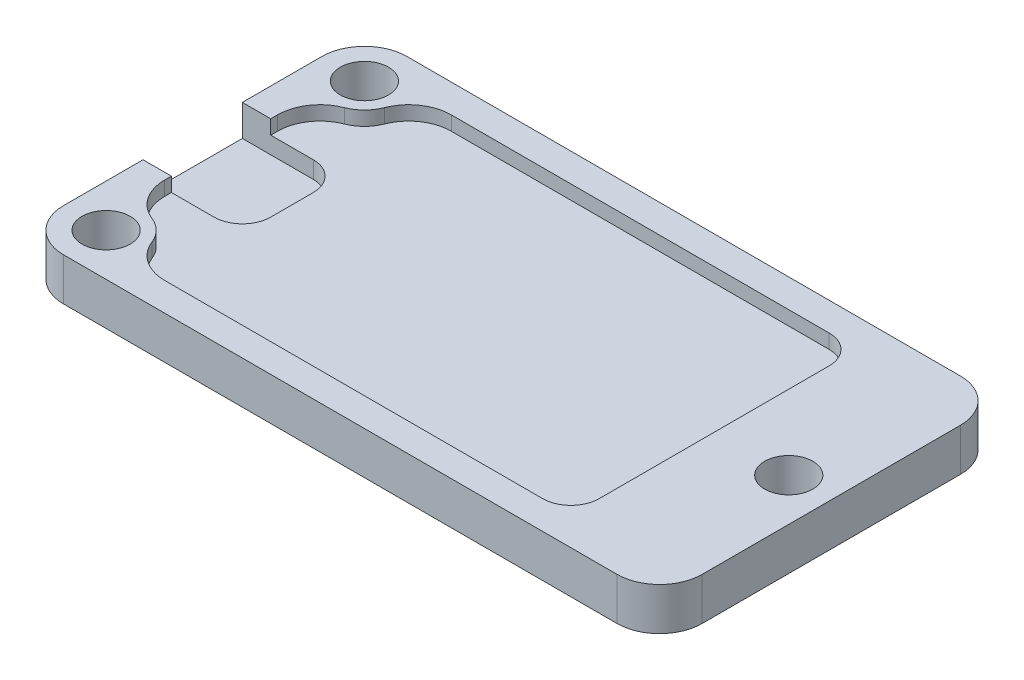
ISO-10303-21;
HEADER;
FILE_DESCRIPTION(('STEP AP214'),'2;1');
FILE_NAME('part.step','',(''),(''),'','','');
FILE_SCHEMA(('AUTOMOTIVE_DESIGN { 1 0 10303 214 1 1 1 1 }'));
ENDSEC;
DATA;
#1=APPLICATION_CONTEXT('core data for automotive mechanical design processes');
#2=APPLICATION_PROTOCOL_DEFINITION('international standard','automotive_design',2000,#1);
#3=PRODUCT_CONTEXT('',#1,'mechanical');
#4=PRODUCT('Part','Part','',(#3));
#5=PRODUCT_RELATED_PRODUCT_CATEGORY('part','',(#4));
#6=PRODUCT_DEFINITION_FORMATION('','',#4);
#7=PRODUCT_DEFINITION_CONTEXT('part definition',#1,'design');
#8=PRODUCT_DEFINITION('design','',#6,#7);
#9=PRODUCT_DEFINITION_SHAPE('','',#8);
#10=(LENGTH_UNIT() NAMED_UNIT(*) SI_UNIT(.MILLI.,.METRE.));
#11=(NAMED_UNIT(*) PLANE_ANGLE_UNIT() SI_UNIT($,.RADIAN.));
#12=(NAMED_UNIT(*) SI_UNIT($,.STERADIAN.) SOLID_ANGLE_UNIT());
#13=UNCERTAINTY_MEASURE_WITH_UNIT(LENGTH_MEASURE(1.E-05),#10,'distance_accuracy_value','');
#14=(GEOMETRIC_REPRESENTATION_CONTEXT(3) GLOBAL_UNCERTAINTY_ASSIGNED_CONTEXT((#13)) GLOBAL_UNIT_ASSIGNED_CONTEXT((#10,
#11,#12)) REPRESENTATION_CONTEXT('',''));
#15=CARTESIAN_POINT('',(0.,0.,0.));
#16=DIRECTION('',(0.,0.,1.));
#17=DIRECTION('',(1.,0.,0.));
#18=AXIS2_PLACEMENT_3D('',#15,#16,#17);
#19=CARTESIAN_POINT('',(2.,2.,-8.1234753829798));
#20=DIRECTION('',(-1.,0.,0.));
#21=DIRECTION('',(0.,0.,1.));
#22=AXIS2_PLACEMENT_3D('',#19,#20,#21);
#23=PLANE('',#22);
#24=DIRECTION('',(0.,0.,1.));
#25=VECTOR('',#24,1.);
#26=CARTESIAN_POINT('',(2.,2.,-8.1234753829798));
#27=LINE('',#26,#25);
#28=CARTESIAN_POINT('',(2.,2.,-8.6));
#29=VERTEX_POINT('',#28);
#30=CARTESIAN_POINT('',(2.,2.,-8.1234753829798));
#31=VERTEX_POINT('',#30);
#32=EDGE_CURVE('E279',#29,#31,#27,.T.);
#33=ORIENTED_EDGE('',*,*,#32,.F.);
#34=DIRECTION('',(0.,1.,0.));
#35=VECTOR('',#34,1.);
#36=CARTESIAN_POINT('',(2.,2.,-8.6));
#37=LINE('',#36,#35);
#38=CARTESIAN_POINT('',(2.,3.,-8.6));
#39=VERTEX_POINT('',#38);
#40=EDGE_CURVE('E251',#29,#39,#37,.T.);
#41=ORIENTED_EDGE('',*,*,#40,.T.);
#42=DIRECTION('',(0.,0.,1.));
#43=VECTOR('',#42,1.);
#44=CARTESIAN_POINT('',(2.,3.,-8.1234753829798));
#45=LINE('',#44,#43);
#46=CARTESIAN_POINT('',(2.,3.,-8.1234753829798));
#47=VERTEX_POINT('',#46);
#48=EDGE_CURVE('E308',#39,#47,#45,.T.);
#49=ORIENTED_EDGE('',*,*,#48,.T.);
#50=DIRECTION('',(0.,1.,0.));
#51=VECTOR('',#50,1.);
#52=CARTESIAN_POINT('',(2.,2.,-8.1234753829798));
#53=LINE('',#52,#51);
#54=EDGE_CURVE('E317',#31,#47,#53,.T.);
#55=ORIENTED_EDGE('',*,*,#54,.F.);
#56=EDGE_LOOP('',(#33,#41,#49,#55));
#57=FACE_BOUND('',#56,.T.);
#58=ADVANCED_FACE('F35',(#57),#23,.F.);
#59=CARTESIAN_POINT('',(0.,3.,0.));
#60=DIRECTION('',(1.,0.,0.));
#61=DIRECTION('',(0.,0.,-1.));
#62=AXIS2_PLACEMENT_3D('',#59,#60,#61);
#63=PLANE('',#62);
#64=DIRECTION('',(0.,0.,1.));
#65=VECTOR('',#64,1.);
#66=CARTESIAN_POINT('',(0.,3.,0.));
#67=LINE('',#66,#65);
#68=CARTESIAN_POINT('',(0.,3.,-8.6));
#69=VERTEX_POINT('',#68);
#70=CARTESIAN_POINT('',(0.,3.,-3.));
#71=VERTEX_POINT('',#70);
#72=EDGE_CURVE('E354',#69,#71,#67,.T.);
#73=ORIENTED_EDGE('',*,*,#72,.F.);
#74=DIRECTION('',(0.,1.,0.));
#75=VECTOR('',#74,1.);
#76=CARTESIAN_POINT('',(0.,0.8,-8.6));
#77=LINE('',#76,#75);
#78=CARTESIAN_POINT('',(0.,0.8,-8.6));
#79=VERTEX_POINT('',#78);
#80=EDGE_CURVE('E236',#79,#69,#77,.T.);
#81=ORIENTED_EDGE('',*,*,#80,.F.);
#82=DIRECTION('',(0.,0.,1.));
#83=VECTOR('',#82,1.);
#84=CARTESIAN_POINT('',(0.,0.8,-8.6));
#85=LINE('',#84,#83);
#86=CARTESIAN_POINT('',(0.,0.8,-15.6));
#87=VERTEX_POINT('',#86);
#88=EDGE_CURVE('E223',#87,#79,#85,.T.);
#89=ORIENTED_EDGE('',*,*,#88,.F.);
#90=DIRECTION('',(0.,1.,0.));
#91=VECTOR('',#90,1.);
#92=CARTESIAN_POINT('',(0.,0.8,-15.6));
#93=LINE('',#92,#91);
#94=CARTESIAN_POINT('',(0.,3.,-15.6));
#95=VERTEX_POINT('',#94);
#96=EDGE_CURVE('E229',#87,#95,#93,.T.);
#97=ORIENTED_EDGE('',*,*,#96,.T.);
#98=CARTESIAN_POINT('',(0.,3.,-21.2));
#99=VERTEX_POINT('',#98);
#100=EDGE_CURVE('E351',#99,#95,#67,.T.);
#101=ORIENTED_EDGE('',*,*,#100,.F.);
#102=DIRECTION('',(0.,-1.,0.));
#103=VECTOR('',#102,1.);
#104=CARTESIAN_POINT('',(0.,3.,-21.2));
#105=LINE('',#104,#103);
#106=CARTESIAN_POINT('',(0.,0.,-21.2));
#107=VERTEX_POINT('',#106);
#108=EDGE_CURVE('E387',#99,#107,#105,.T.);
#109=ORIENTED_EDGE('',*,*,#108,.T.);
#110=DIRECTION('',(0.,0.,1.));
#111=VECTOR('',#110,1.);
#112=CARTESIAN_POINT('',(0.,0.,0.));
#113=LINE('',#112,#111);
#114=CARTESIAN_POINT('',(0.,0.,-3.));
#115=VERTEX_POINT('',#114);
#116=EDGE_CURVE('E350',#107,#115,#113,.T.);
#117=ORIENTED_EDGE('',*,*,#116,.T.);
#118=DIRECTION('',(0.,-1.,0.));
#119=VECTOR('',#118,1.);
#120=CARTESIAN_POINT('',(0.,3.,-3.));
#121=LINE('',#120,#119);
#122=EDGE_CURVE('E390',#115,#71,#121,.F.);
#123=ORIENTED_EDGE('',*,*,#122,.T.);
#124=EDGE_LOOP('',(#73,#81,#89,#97,#101,#109,#117,#123));
#125=FACE_BOUND('',#124,.T.);
#126=ADVANCED_FACE('F239',(#125),#63,.F.);
#127=CARTESIAN_POINT('',(0.,3.,0.));
#128=DIRECTION('',(0.,0.,-1.));
#129=DIRECTION('',(-1.,0.,0.));
#130=AXIS2_PLACEMENT_3D('',#127,#128,#129);
#131=PLANE('',#130);
#132=DIRECTION('',(1.,0.,0.));
#133=VECTOR('',#132,1.);
#134=CARTESIAN_POINT('',(0.,3.,0.));
#135=LINE('',#134,#133);
#136=CARTESIAN_POINT('',(3.,3.,0.));
#137=VERTEX_POINT('',#136);
#138=CARTESIAN_POINT('',(42.,3.,0.));
#139=VERTEX_POINT('',#138);
#140=EDGE_CURVE('E353',#137,#139,#135,.T.);
#141=ORIENTED_EDGE('',*,*,#140,.F.);
#142=DIRECTION('',(0.,-1.,0.));
#143=VECTOR('',#142,1.);
#144=CARTESIAN_POINT('',(3.,3.,0.));
#145=LINE('',#144,#143);
#146=CARTESIAN_POINT('',(3.,0.,0.));
#147=VERTEX_POINT('',#146);
#148=EDGE_CURVE('E376',#137,#147,#145,.T.);
#149=ORIENTED_EDGE('',*,*,#148,.T.);
#150=DIRECTION('',(1.,0.,0.));
#151=VECTOR('',#150,1.);
#152=CARTESIAN_POINT('',(0.,0.,0.));
#153=LINE('',#152,#151);
#154=CARTESIAN_POINT('',(42.,0.,0.));
#155=VERTEX_POINT('',#154);
#156=EDGE_CURVE('E366',#147,#155,#153,.T.);
#157=ORIENTED_EDGE('',*,*,#156,.T.);
#158=DIRECTION('',(0.,-1.,0.));
#159=VECTOR('',#158,1.);
#160=CARTESIAN_POINT('',(42.,3.,0.));
#161=LINE('',#160,#159);
#162=EDGE_CURVE('E363',#155,#139,#161,.F.);
#163=ORIENTED_EDGE('',*,*,#162,.T.);
#164=EDGE_LOOP('',(#141,#149,#157,#163));
#165=FACE_BOUND('',#164,.T.);
#166=ADVANCED_FACE('F503',(#165),#131,.F.);
#167=CARTESIAN_POINT('',(45.,3.,0.));
#168=DIRECTION('',(-1.,0.,0.));
#169=DIRECTION('',(0.,0.,1.));
#170=AXIS2_PLACEMENT_3D('',#167,#168,#169);
#171=PLANE('',#170);
#172=DIRECTION('',(0.,0.,-1.));
#173=VECTOR('',#172,1.);
#174=CARTESIAN_POINT('',(45.,3.,0.));
#175=LINE('',#174,#173);
#176=CARTESIAN_POINT('',(45.,3.,-3.));
#177=VERTEX_POINT('',#176);
#178=CARTESIAN_POINT('',(45.,3.,-21.2));
#179=VERTEX_POINT('',#178);
#180=EDGE_CURVE('E357',#177,#179,#175,.T.);
#181=ORIENTED_EDGE('',*,*,#180,.F.);
#182=DIRECTION('',(0.,-1.,0.));
#183=VECTOR('',#182,1.);
#184=CARTESIAN_POINT('',(45.,3.,-3.));
#185=LINE('',#184,#183);
#186=CARTESIAN_POINT('',(45.,0.,-3.));
#187=VERTEX_POINT('',#186);
#188=EDGE_CURVE('E403',#177,#187,#185,.T.);
#189=ORIENTED_EDGE('',*,*,#188,.T.);
#190=DIRECTION('',(0.,0.,-1.));
#191=VECTOR('',#190,1.);
#192=CARTESIAN_POINT('',(45.,0.,0.));
#193=LINE('',#192,#191);
#194=CARTESIAN_POINT('',(45.,0.,-21.2));
#195=VERTEX_POINT('',#194);
#196=EDGE_CURVE('E369',#187,#195,#193,.T.);
#197=ORIENTED_EDGE('',*,*,#196,.T.);
#198=DIRECTION('',(0.,-1.,0.));
#199=VECTOR('',#198,1.);
#200=CARTESIAN_POINT('',(45.,3.,-21.2));
#201=LINE('',#200,#199);
#202=EDGE_CURVE('E401',#195,#179,#201,.F.);
#203=ORIENTED_EDGE('',*,*,#202,.T.);
#204=EDGE_LOOP('',(#181,#189,#197,#203));
#205=FACE_BOUND('',#204,.T.);
#206=ADVANCED_FACE('F495',(#205),#171,.F.);
#207=CARTESIAN_POINT('',(0.,3.,-24.2));
#208=DIRECTION('',(0.,0.,1.));
#209=DIRECTION('',(1.,0.,0.));
#210=AXIS2_PLACEMENT_3D('',#207,#208,#209);
#211=PLANE('',#210);
#212=DIRECTION('',(-1.,0.,0.));
#213=VECTOR('',#212,1.);
#214=CARTESIAN_POINT('',(0.,3.,-24.2));
#215=LINE('',#214,#213);
#216=CARTESIAN_POINT('',(42.,3.,-24.2));
#217=VERTEX_POINT('',#216);
#218=CARTESIAN_POINT('',(3.,3.,-24.2));
#219=VERTEX_POINT('',#218);
#220=EDGE_CURVE('E360',#217,#219,#215,.T.);
#221=ORIENTED_EDGE('',*,*,#220,.F.);
#222=DIRECTION('',(0.,-1.,0.));
#223=VECTOR('',#222,1.);
#224=CARTESIAN_POINT('',(42.,3.,-24.2));
#225=LINE('',#224,#223);
#226=CARTESIAN_POINT('',(42.,0.,-24.2));
#227=VERTEX_POINT('',#226);
#228=EDGE_CURVE('E408',#217,#227,#225,.T.);
#229=ORIENTED_EDGE('',*,*,#228,.T.);
#230=DIRECTION('',(-1.,0.,0.));
#231=VECTOR('',#230,1.);
#232=CARTESIAN_POINT('',(0.,0.,-24.2));
#233=LINE('',#232,#231);
#234=CARTESIAN_POINT('',(3.,0.,-24.2));
#235=VERTEX_POINT('',#234);
#236=EDGE_CURVE('E372',#227,#235,#233,.T.);
#237=ORIENTED_EDGE('',*,*,#236,.T.);
#238=DIRECTION('',(0.,-1.,0.));
#239=VECTOR('',#238,1.);
#240=CARTESIAN_POINT('',(3.,3.,-24.2));
#241=LINE('',#240,#239);
#242=EDGE_CURVE('E406',#235,#219,#241,.F.);
#243=ORIENTED_EDGE('',*,*,#242,.T.);
#244=EDGE_LOOP('',(#221,#229,#237,#243));
#245=FACE_BOUND('',#244,.T.);
#246=ADVANCED_FACE('F486',(#245),#211,.F.);
#247=CARTESIAN_POINT('',(0.,3.,0.));
#248=DIRECTION('',(0.,-1.,0.));
#249=DIRECTION('',(0.,0.,-1.));
#250=AXIS2_PLACEMENT_3D('',#247,#248,#249);
#251=PLANE('',#250);
#252=CARTESIAN_POINT('',(3.,3.,-21.2));
#253=DIRECTION('',(0.,-1.,0.));
#254=DIRECTION('',(0.,0.,-1.));
#255=AXIS2_PLACEMENT_3D('',#252,#253,#254);
#256=CIRCLE('',#255,1.69999999999999);
#257=CARTESIAN_POINT('',(3.,3.,-22.9));
#258=VERTEX_POINT('',#257);
#259=EDGE_CURVE('E335',#258,#258,#256,.T.);
#260=ORIENTED_EDGE('',*,*,#259,.T.);
#261=EDGE_LOOP('',(#260));
#262=FACE_BOUND('',#261,.T.);
#263=CARTESIAN_POINT('',(3.,3.,-3.));
#264=DIRECTION('',(0.,-1.,0.));
#265=DIRECTION('',(0.,0.,-1.));
#266=AXIS2_PLACEMENT_3D('',#263,#264,#265);
#267=CIRCLE('',#266,1.69999999999999);
#268=CARTESIAN_POINT('',(3.,3.,-4.69999999999999));
#269=VERTEX_POINT('',#268);
#270=EDGE_CURVE('E341',#269,#269,#267,.T.);
#271=ORIENTED_EDGE('',*,*,#270,.T.);
#272=EDGE_LOOP('',(#271));
#273=FACE_BOUND('',#272,.T.);
#274=CARTESIAN_POINT('',(42.,3.,-12.1));
#275=DIRECTION('',(0.,-1.,0.));
#276=DIRECTION('',(0.,0.,-1.));
#277=AXIS2_PLACEMENT_3D('',#274,#275,#276);
#278=CIRCLE('',#277,1.69999999999999);
#279=CARTESIAN_POINT('',(42.,3.,-13.8));
#280=VERTEX_POINT('',#279);
#281=EDGE_CURVE('E347',#280,#280,#278,.T.);
#282=ORIENTED_EDGE('',*,*,#281,.T.);
#283=EDGE_LOOP('',(#282));
#284=FACE_BOUND('',#283,.T.);
#285=ORIENTED_EDGE('',*,*,#48,.F.);
#286=DIRECTION('',(1.,0.,0.));
#287=VECTOR('',#286,1.);
#288=CARTESIAN_POINT('',(7.,3.,-8.6));
#289=LINE('',#288,#287);
#290=EDGE_CURVE('E243',#69,#39,#289,.T.);
#291=ORIENTED_EDGE('',*,*,#290,.F.);
#292=ORIENTED_EDGE('',*,*,#72,.T.);
#293=CARTESIAN_POINT('',(3.,3.,-3.));
#294=DIRECTION('',(0.,-1.,0.));
#295=DIRECTION('',(0.,0.,-1.));
#296=AXIS2_PLACEMENT_3D('',#293,#294,#295);
#297=CIRCLE('',#296,3.);
#298=EDGE_CURVE('E399',#71,#137,#297,.F.);
#299=ORIENTED_EDGE('',*,*,#298,.T.);
#300=ORIENTED_EDGE('',*,*,#140,.T.);
#301=CARTESIAN_POINT('',(42.,3.,-3.));
#302=DIRECTION('',(0.,-1.,0.));
#303=DIRECTION('',(0.,0.,-1.));
#304=AXIS2_PLACEMENT_3D('',#301,#302,#303);
#305=CIRCLE('',#304,3.);
#306=EDGE_CURVE('E397',#139,#177,#305,.F.);
#307=ORIENTED_EDGE('',*,*,#306,.T.);
#308=ORIENTED_EDGE('',*,*,#180,.T.);
#309=CARTESIAN_POINT('',(42.,3.,-21.2));
#310=DIRECTION('',(0.,-1.,0.));
#311=DIRECTION('',(0.,0.,-1.));
#312=AXIS2_PLACEMENT_3D('',#309,#310,#311);
#313=CIRCLE('',#312,3.);
#314=EDGE_CURVE('E395',#179,#217,#313,.F.);
#315=ORIENTED_EDGE('',*,*,#314,.T.);
#316=ORIENTED_EDGE('',*,*,#220,.T.);
#317=CARTESIAN_POINT('',(3.,3.,-21.2));
#318=DIRECTION('',(0.,-1.,0.));
#319=DIRECTION('',(0.,0.,-1.));
#320=AXIS2_PLACEMENT_3D('',#317,#318,#319);
#321=CIRCLE('',#320,3.);
#322=EDGE_CURVE('E393',#219,#99,#321,.F.);
#323=ORIENTED_EDGE('',*,*,#322,.T.);
#324=ORIENTED_EDGE('',*,*,#100,.T.);
#325=DIRECTION('',(-1.,0.,0.));
#326=VECTOR('',#325,1.);
#327=CARTESIAN_POINT('',(0.,3.,-15.6));
#328=LINE('',#327,#326);
#329=CARTESIAN_POINT('',(2.,3.,-15.6));
#330=VERTEX_POINT('',#329);
#331=EDGE_CURVE('E232',#330,#95,#328,.T.);
#332=ORIENTED_EDGE('',*,*,#331,.F.);
#333=CARTESIAN_POINT('',(2.,3.,-16.0765246170202));
#334=VERTEX_POINT('',#333);
#335=EDGE_CURVE('E309',#334,#330,#45,.T.);
#336=ORIENTED_EDGE('',*,*,#335,.F.);
#337=CARTESIAN_POINT('',(4.99999999999999,3.,-16.0765246170202));
#338=DIRECTION('',(0.,1.,0.));
#339=DIRECTION('',(0.,0.,1.));
#340=AXIS2_PLACEMENT_3D('',#337,#338,#339);
#341=CIRCLE('',#340,3.);
#342=CARTESIAN_POINT('',(3.9090909090909,3.,-18.871147553191));
#343=VERTEX_POINT('',#342);
#344=EDGE_CURVE('E305',#343,#334,#341,.T.);
#345=ORIENTED_EDGE('',*,*,#344,.F.);
#346=CARTESIAN_POINT('',(3.,3.,-21.2));
#347=DIRECTION('',(0.,-1.,0.));
#348=DIRECTION('',(0.,0.,1.));
#349=AXIS2_PLACEMENT_3D('',#346,#347,#348);
#350=CIRCLE('',#349,2.5);
#351=CARTESIAN_POINT('',(5.328852446809,3.,-20.2909090909091));
#352=VERTEX_POINT('',#351);
#353=EDGE_CURVE('E302',#352,#343,#350,.T.);
#354=ORIENTED_EDGE('',*,*,#353,.F.);
#355=CARTESIAN_POINT('',(8.1234753829798,3.,-19.2));
#356=DIRECTION('',(0.,1.,0.));
#357=DIRECTION('',(0.,0.,1.));
#358=AXIS2_PLACEMENT_3D('',#355,#356,#357);
#359=CIRCLE('',#358,3.);
#360=CARTESIAN_POINT('',(8.1234753829798,3.,-22.2));
#361=VERTEX_POINT('',#360);
#362=EDGE_CURVE('E299',#361,#352,#359,.T.);
#363=ORIENTED_EDGE('',*,*,#362,.F.);
#364=DIRECTION('',(-1.,0.,0.));
#365=VECTOR('',#364,1.);
#366=CARTESIAN_POINT('',(8.1234753829798,3.,-22.2));
#367=LINE('',#366,#365);
#368=CARTESIAN_POINT('',(34.7526473567604,3.,-22.2));
#369=VERTEX_POINT('',#368);
#370=EDGE_CURVE('E297',#369,#361,#367,.T.);
#371=ORIENTED_EDGE('',*,*,#370,.F.);
#372=CARTESIAN_POINT('',(34.7526473567604,3.,-20.2));
#373=DIRECTION('',(0.,-1.,0.));
#374=DIRECTION('',(0.,0.,-1.));
#375=AXIS2_PLACEMENT_3D('',#372,#373,#374);
#376=CIRCLE('',#375,2.);
#377=CARTESIAN_POINT('',(36.7526473567604,3.,-20.2));
#378=VERTEX_POINT('',#377);
#379=EDGE_CURVE('E427',#369,#378,#376,.T.);
#380=ORIENTED_EDGE('',*,*,#379,.T.);
#381=DIRECTION('',(0.,0.,-1.));
#382=VECTOR('',#381,1.);
#383=CARTESIAN_POINT('',(36.7526473567604,3.,-2.));
#384=LINE('',#383,#382);
#385=CARTESIAN_POINT('',(36.7526473567604,3.,-4.));
#386=VERTEX_POINT('',#385);
#387=EDGE_CURVE('E294',#386,#378,#384,.T.);
#388=ORIENTED_EDGE('',*,*,#387,.F.);
#389=CARTESIAN_POINT('',(34.7526473567604,3.,-4.));
#390=DIRECTION('',(0.,-1.,0.));
#391=DIRECTION('',(0.,0.,-1.));
#392=AXIS2_PLACEMENT_3D('',#389,#390,#391);
#393=CIRCLE('',#392,2.);
#394=CARTESIAN_POINT('',(34.7526473567604,3.,-2.));
#395=VERTEX_POINT('',#394);
#396=EDGE_CURVE('E425',#386,#395,#393,.T.);
#397=ORIENTED_EDGE('',*,*,#396,.T.);
#398=DIRECTION('',(1.,0.,0.));
#399=VECTOR('',#398,1.);
#400=CARTESIAN_POINT('',(36.7526473567604,3.,-2.));
#401=LINE('',#400,#399);
#402=CARTESIAN_POINT('',(8.1234753829798,3.,-1.99999999999999));
#403=VERTEX_POINT('',#402);
#404=EDGE_CURVE('E291',#403,#395,#401,.T.);
#405=ORIENTED_EDGE('',*,*,#404,.F.);
#406=CARTESIAN_POINT('',(8.1234753829798,3.,-4.99999999999999));
#407=DIRECTION('',(0.,1.,0.));
#408=DIRECTION('',(0.,0.,1.));
#409=AXIS2_PLACEMENT_3D('',#406,#407,#408);
#410=CIRCLE('',#409,3.);
#411=CARTESIAN_POINT('',(5.328852446809,3.,-3.90909090909091));
#412=VERTEX_POINT('',#411);
#413=EDGE_CURVE('E288',#412,#403,#410,.T.);
#414=ORIENTED_EDGE('',*,*,#413,.F.);
#415=CARTESIAN_POINT('',(3.,3.,-3.));
#416=DIRECTION('',(0.,-1.,0.));
#417=DIRECTION('',(0.,0.,1.));
#418=AXIS2_PLACEMENT_3D('',#415,#416,#417);
#419=CIRCLE('',#418,2.5);
#420=CARTESIAN_POINT('',(3.90909090909091,3.,-5.328852446809));
#421=VERTEX_POINT('',#420);
#422=EDGE_CURVE('E254',#421,#412,#419,.T.);
#423=ORIENTED_EDGE('',*,*,#422,.F.);
#424=CARTESIAN_POINT('',(5.,3.,-8.1234753829798));
#425=DIRECTION('',(0.,1.,0.));
#426=DIRECTION('',(0.,0.,1.));
#427=AXIS2_PLACEMENT_3D('',#424,#425,#426);
#428=CIRCLE('',#427,3.);
#429=EDGE_CURVE('E259',#47,#421,#428,.T.);
#430=ORIENTED_EDGE('',*,*,#429,.F.);
#431=EDGE_LOOP('',(#285,#291,#292,#299,#300,#307,#308,#315,#316,#323,#324,#332,#336,#345,#354,
#363,#371,#380,#388,#397,#405,#414,#423,#430));
#432=FACE_BOUND('',#431,.T.);
#433=ADVANCED_FACE('F472',(#262,#273,#284,#432),#251,.F.);
#434=CARTESIAN_POINT('',(0.,0.,0.));
#435=DIRECTION('',(0.,-1.,0.));
#436=DIRECTION('',(0.,0.,-1.));
#437=AXIS2_PLACEMENT_3D('',#434,#435,#436);
#438=PLANE('',#437);
#439=CARTESIAN_POINT('',(3.,0.,-21.2));
#440=DIRECTION('',(0.,-1.,0.));
#441=DIRECTION('',(0.,0.,-1.));
#442=AXIS2_PLACEMENT_3D('',#439,#440,#441);
#443=CIRCLE('',#442,1.69999999999999);
#444=CARTESIAN_POINT('',(3.,0.,-22.9));
#445=VERTEX_POINT('',#444);
#446=EDGE_CURVE('E316',#445,#445,#443,.T.);
#447=ORIENTED_EDGE('',*,*,#446,.F.);
#448=EDGE_LOOP('',(#447));
#449=FACE_BOUND('',#448,.T.);
#450=CARTESIAN_POINT('',(3.,0.,-3.));
#451=DIRECTION('',(0.,-1.,0.));
#452=DIRECTION('',(0.,0.,-1.));
#453=AXIS2_PLACEMENT_3D('',#450,#451,#452);
#454=CIRCLE('',#453,1.69999999999999);
#455=CARTESIAN_POINT('',(3.,0.,-4.69999999999999));
#456=VERTEX_POINT('',#455);
#457=EDGE_CURVE('E338',#456,#456,#454,.T.);
#458=ORIENTED_EDGE('',*,*,#457,.F.);
#459=EDGE_LOOP('',(#458));
#460=FACE_BOUND('',#459,.T.);
#461=CARTESIAN_POINT('',(42.,0.,-12.1));
#462=DIRECTION('',(0.,-1.,0.));
#463=DIRECTION('',(0.,0.,-1.));
#464=AXIS2_PLACEMENT_3D('',#461,#462,#463);
#465=CIRCLE('',#464,1.69999999999999);
#466=CARTESIAN_POINT('',(42.,0.,-13.8));
#467=VERTEX_POINT('',#466);
#468=EDGE_CURVE('E344',#467,#467,#465,.T.);
#469=ORIENTED_EDGE('',*,*,#468,.F.);
#470=EDGE_LOOP('',(#469));
#471=FACE_BOUND('',#470,.T.);
#472=ORIENTED_EDGE('',*,*,#156,.F.);
#473=CARTESIAN_POINT('',(3.,0.,-3.));
#474=DIRECTION('',(0.,-1.,0.));
#475=DIRECTION('',(0.,0.,-1.));
#476=AXIS2_PLACEMENT_3D('',#473,#474,#475);
#477=CIRCLE('',#476,3.);
#478=EDGE_CURVE('E385',#147,#115,#477,.T.);
#479=ORIENTED_EDGE('',*,*,#478,.T.);
#480=ORIENTED_EDGE('',*,*,#116,.F.);
#481=CARTESIAN_POINT('',(3.,0.,-21.2));
#482=DIRECTION('',(0.,-1.,0.));
#483=DIRECTION('',(0.,0.,-1.));
#484=AXIS2_PLACEMENT_3D('',#481,#482,#483);
#485=CIRCLE('',#484,3.);
#486=EDGE_CURVE('E379',#107,#235,#485,.T.);
#487=ORIENTED_EDGE('',*,*,#486,.T.);
#488=ORIENTED_EDGE('',*,*,#236,.F.);
#489=CARTESIAN_POINT('',(42.,0.,-21.2));
#490=DIRECTION('',(0.,-1.,0.));
#491=DIRECTION('',(0.,0.,-1.));
#492=AXIS2_PLACEMENT_3D('',#489,#490,#491);
#493=CIRCLE('',#492,3.);
#494=EDGE_CURVE('E381',#227,#195,#493,.T.);
#495=ORIENTED_EDGE('',*,*,#494,.T.);
#496=ORIENTED_EDGE('',*,*,#196,.F.);
#497=CARTESIAN_POINT('',(42.,0.,-3.));
#498=DIRECTION('',(0.,-1.,0.));
#499=DIRECTION('',(0.,0.,-1.));
#500=AXIS2_PLACEMENT_3D('',#497,#498,#499);
#501=CIRCLE('',#500,3.);
#502=EDGE_CURVE('E383',#187,#155,#501,.T.);
#503=ORIENTED_EDGE('',*,*,#502,.T.);
#504=EDGE_LOOP('',(#472,#479,#480,#487,#488,#495,#496,#503));
#505=FACE_BOUND('',#504,.T.);
#506=ADVANCED_FACE('F483',(#449,#460,#471,#505),#438,.T.);
#507=CARTESIAN_POINT('',(3.,3.,-3.));
#508=DIRECTION('',(0.,-1.,0.));
#509=DIRECTION('',(0.,0.,-1.));
#510=AXIS2_PLACEMENT_3D('',#507,#508,#509);
#511=CYLINDRICAL_SURFACE('',#510,3.);
#512=ORIENTED_EDGE('',*,*,#298,.F.);
#513=ORIENTED_EDGE('',*,*,#122,.F.);
#514=ORIENTED_EDGE('',*,*,#478,.F.);
#515=ORIENTED_EDGE('',*,*,#148,.F.);
#516=EDGE_LOOP('',(#512,#513,#514,#515));
#517=FACE_BOUND('',#516,.T.);
#518=ADVANCED_FACE('F507',(#517),#511,.T.);
#519=CARTESIAN_POINT('',(42.,3.,-3.));
#520=DIRECTION('',(0.,-1.,0.));
#521=DIRECTION('',(0.,0.,-1.));
#522=AXIS2_PLACEMENT_3D('',#519,#520,#521);
#523=CYLINDRICAL_SURFACE('',#522,3.);
#524=ORIENTED_EDGE('',*,*,#306,.F.);
#525=ORIENTED_EDGE('',*,*,#162,.F.);
#526=ORIENTED_EDGE('',*,*,#502,.F.);
#527=ORIENTED_EDGE('',*,*,#188,.F.);
#528=EDGE_LOOP('',(#524,#525,#526,#527));
#529=FACE_BOUND('',#528,.T.);
#530=ADVANCED_FACE('F499',(#529),#523,.T.);
#531=CARTESIAN_POINT('',(42.,3.,-21.2));
#532=DIRECTION('',(0.,-1.,0.));
#533=DIRECTION('',(0.,0.,-1.));
#534=AXIS2_PLACEMENT_3D('',#531,#532,#533);
#535=CYLINDRICAL_SURFACE('',#534,3.);
#536=ORIENTED_EDGE('',*,*,#314,.F.);
#537=ORIENTED_EDGE('',*,*,#202,.F.);
#538=ORIENTED_EDGE('',*,*,#494,.F.);
#539=ORIENTED_EDGE('',*,*,#228,.F.);
#540=EDGE_LOOP('',(#536,#537,#538,#539));
#541=FACE_BOUND('',#540,.T.);
#542=ADVANCED_FACE('F490',(#541),#535,.T.);
#543=CARTESIAN_POINT('',(3.,3.,-21.2));
#544=DIRECTION('',(0.,-1.,0.));
#545=DIRECTION('',(0.,0.,-1.));
#546=AXIS2_PLACEMENT_3D('',#543,#544,#545);
#547=CYLINDRICAL_SURFACE('',#546,3.);
#548=ORIENTED_EDGE('',*,*,#322,.F.);
#549=ORIENTED_EDGE('',*,*,#242,.F.);
#550=ORIENTED_EDGE('',*,*,#486,.F.);
#551=ORIENTED_EDGE('',*,*,#108,.F.);
#552=EDGE_LOOP('',(#548,#549,#550,#551));
#553=FACE_BOUND('',#552,.T.);
#554=ADVANCED_FACE('F478',(#553),#547,.T.);
#555=CARTESIAN_POINT('',(42.,0.,-12.1));
#556=DIRECTION('',(0.,-1.,0.));
#557=DIRECTION('',(0.,0.,-1.));
#558=AXIS2_PLACEMENT_3D('',#555,#556,#557);
#559=CYLINDRICAL_SURFACE('',#558,1.69999999999999);
#560=ORIENTED_EDGE('',*,*,#281,.F.);
#561=EDGE_LOOP('',(#560));
#562=FACE_BOUND('',#561,.T.);
#563=ORIENTED_EDGE('',*,*,#468,.T.);
#564=EDGE_LOOP('',(#563));
#565=FACE_BOUND('',#564,.T.);
#566=ADVANCED_FACE('F595',(#562,#565),#559,.F.);
#567=CARTESIAN_POINT('',(3.,0.,-3.));
#568=DIRECTION('',(0.,-1.,0.));
#569=DIRECTION('',(0.,0.,-1.));
#570=AXIS2_PLACEMENT_3D('',#567,#568,#569);
#571=CYLINDRICAL_SURFACE('',#570,1.69999999999999);
#572=ORIENTED_EDGE('',*,*,#270,.F.);
#573=EDGE_LOOP('',(#572));
#574=FACE_BOUND('',#573,.T.);
#575=ORIENTED_EDGE('',*,*,#457,.T.);
#576=EDGE_LOOP('',(#575));
#577=FACE_BOUND('',#576,.T.);
#578=ADVANCED_FACE('F615',(#574,#577),#571,.F.);
#579=CARTESIAN_POINT('',(3.,0.,-21.2));
#580=DIRECTION('',(0.,-1.,0.));
#581=DIRECTION('',(0.,0.,-1.));
#582=AXIS2_PLACEMENT_3D('',#579,#580,#581);
#583=CYLINDRICAL_SURFACE('',#582,1.69999999999999);
#584=ORIENTED_EDGE('',*,*,#259,.F.);
#585=EDGE_LOOP('',(#584));
#586=FACE_BOUND('',#585,.T.);
#587=ORIENTED_EDGE('',*,*,#446,.T.);
#588=EDGE_LOOP('',(#587));
#589=FACE_BOUND('',#588,.T.);
#590=ADVANCED_FACE('F619',(#586,#589),#583,.F.);
#591=CARTESIAN_POINT('',(3.,2.,-3.));
#592=DIRECTION('',(0.,1.,0.));
#593=DIRECTION('',(0.,0.,1.));
#594=AXIS2_PLACEMENT_3D('',#591,#592,#593);
#595=CYLINDRICAL_SURFACE('',#594,2.5);
#596=ORIENTED_EDGE('',*,*,#422,.T.);
#597=DIRECTION('',(0.,1.,0.));
#598=VECTOR('',#597,1.);
#599=CARTESIAN_POINT('',(5.328852446809,2.,-3.90909090909091));
#600=LINE('',#599,#598);
#601=CARTESIAN_POINT('',(5.328852446809,2.,-3.90909090909091));
#602=VERTEX_POINT('',#601);
#603=EDGE_CURVE('E286',#602,#412,#600,.T.);
#604=ORIENTED_EDGE('',*,*,#603,.F.);
#605=CARTESIAN_POINT('',(3.,2.,-3.));
#606=DIRECTION('',(0.,-1.,0.));
#607=DIRECTION('',(0.,0.,1.));
#608=AXIS2_PLACEMENT_3D('',#605,#606,#607);
#609=CIRCLE('',#608,2.5);
#610=CARTESIAN_POINT('',(3.90909090909091,2.,-5.328852446809));
#611=VERTEX_POINT('',#610);
#612=EDGE_CURVE('E255',#611,#602,#609,.T.);
#613=ORIENTED_EDGE('',*,*,#612,.F.);
#614=DIRECTION('',(0.,1.,0.));
#615=VECTOR('',#614,1.);
#616=CARTESIAN_POINT('',(3.90909090909091,2.,-5.328852446809));
#617=LINE('',#616,#615);
#618=EDGE_CURVE('E314',#611,#421,#617,.T.);
#619=ORIENTED_EDGE('',*,*,#618,.T.);
#620=EDGE_LOOP('',(#596,#604,#613,#619));
#621=FACE_BOUND('',#620,.T.);
#622=ADVANCED_FACE('F519',(#621),#595,.T.);
#623=CARTESIAN_POINT('',(5.,2.,-8.1234753829798));
#624=DIRECTION('',(0.,1.,0.));
#625=DIRECTION('',(0.,0.,1.));
#626=AXIS2_PLACEMENT_3D('',#623,#624,#625);
#627=CYLINDRICAL_SURFACE('',#626,3.);
#628=ORIENTED_EDGE('',*,*,#429,.T.);
#629=ORIENTED_EDGE('',*,*,#618,.F.);
#630=CARTESIAN_POINT('',(5.,2.,-8.1234753829798));
#631=DIRECTION('',(0.,1.,0.));
#632=DIRECTION('',(0.,0.,1.));
#633=AXIS2_PLACEMENT_3D('',#630,#631,#632);
#634=CIRCLE('',#633,3.);
#635=EDGE_CURVE('E283',#31,#611,#634,.T.);
#636=ORIENTED_EDGE('',*,*,#635,.F.);
#637=ORIENTED_EDGE('',*,*,#54,.T.);
#638=EDGE_LOOP('',(#628,#629,#636,#637));
#639=FACE_BOUND('',#638,.T.);
#640=ADVANCED_FACE('F516',(#639),#627,.F.);
#641=ORIENTED_EDGE('',*,*,#335,.T.);
#642=DIRECTION('',(0.,-1.,0.));
#643=VECTOR('',#642,1.);
#644=CARTESIAN_POINT('',(2.,2.,-15.6));
#645=LINE('',#644,#643);
#646=CARTESIAN_POINT('',(2.,2.,-15.6));
#647=VERTEX_POINT('',#646);
#648=EDGE_CURVE('E247',#330,#647,#645,.T.);
#649=ORIENTED_EDGE('',*,*,#648,.T.);
#650=CARTESIAN_POINT('',(2.,2.,-16.0765246170202));
#651=VERTEX_POINT('',#650);
#652=EDGE_CURVE('E280',#651,#647,#27,.T.);
#653=ORIENTED_EDGE('',*,*,#652,.F.);
#654=DIRECTION('',(0.,1.,0.));
#655=VECTOR('',#654,1.);
#656=CARTESIAN_POINT('',(2.,2.,-16.0765246170202));
#657=LINE('',#656,#655);
#658=EDGE_CURVE('E320',#651,#334,#657,.T.);
#659=ORIENTED_EDGE('',*,*,#658,.T.);
#660=EDGE_LOOP('',(#641,#649,#653,#659));
#661=FACE_BOUND('',#660,.T.);
#662=ADVANCED_FACE('F468',(#661),#23,.F.);
#663=CARTESIAN_POINT('',(4.99999999999999,2.,-16.0765246170202));
#664=DIRECTION('',(0.,1.,0.));
#665=DIRECTION('',(0.,0.,1.));
#666=AXIS2_PLACEMENT_3D('',#663,#664,#665);
#667=CYLINDRICAL_SURFACE('',#666,3.);
#668=ORIENTED_EDGE('',*,*,#344,.T.);
#669=ORIENTED_EDGE('',*,*,#658,.F.);
#670=CARTESIAN_POINT('',(4.99999999999999,2.,-16.0765246170202));
#671=DIRECTION('',(0.,1.,0.));
#672=DIRECTION('',(0.,0.,1.));
#673=AXIS2_PLACEMENT_3D('',#670,#671,#672);
#674=CIRCLE('',#673,3.);
#675=CARTESIAN_POINT('',(3.9090909090909,2.,-18.871147553191));
#676=VERTEX_POINT('',#675);
#677=EDGE_CURVE('E276',#676,#651,#674,.T.);
#678=ORIENTED_EDGE('',*,*,#677,.F.);
#679=DIRECTION('',(0.,1.,0.));
#680=VECTOR('',#679,1.);
#681=CARTESIAN_POINT('',(3.9090909090909,2.,-18.871147553191));
#682=LINE('',#681,#680);
#683=EDGE_CURVE('E322',#676,#343,#682,.T.);
#684=ORIENTED_EDGE('',*,*,#683,.T.);
#685=EDGE_LOOP('',(#668,#669,#678,#684));
#686=FACE_BOUND('',#685,.T.);
#687=ADVANCED_FACE('F555',(#686),#667,.F.);
#688=CARTESIAN_POINT('',(3.,2.,-21.2));
#689=DIRECTION('',(0.,1.,0.));
#690=DIRECTION('',(0.,0.,1.));
#691=AXIS2_PLACEMENT_3D('',#688,#689,#690);
#692=CYLINDRICAL_SURFACE('',#691,2.5);
#693=ORIENTED_EDGE('',*,*,#353,.T.);
#694=ORIENTED_EDGE('',*,*,#683,.F.);
#695=CARTESIAN_POINT('',(3.,2.,-21.2));
#696=DIRECTION('',(0.,-1.,0.));
#697=DIRECTION('',(0.,0.,1.));
#698=AXIS2_PLACEMENT_3D('',#695,#696,#697);
#699=CIRCLE('',#698,2.5);
#700=CARTESIAN_POINT('',(5.328852446809,2.,-20.2909090909091));
#701=VERTEX_POINT('',#700);
#702=EDGE_CURVE('E273',#701,#676,#699,.T.);
#703=ORIENTED_EDGE('',*,*,#702,.F.);
#704=DIRECTION('',(0.,1.,0.));
#705=VECTOR('',#704,1.);
#706=CARTESIAN_POINT('',(5.328852446809,2.,-20.2909090909091));
#707=LINE('',#706,#705);
#708=EDGE_CURVE('E324',#701,#352,#707,.T.);
#709=ORIENTED_EDGE('',*,*,#708,.T.);
#710=EDGE_LOOP('',(#693,#694,#703,#709));
#711=FACE_BOUND('',#710,.T.);
#712=ADVANCED_FACE('F553',(#711),#692,.T.);
#713=CARTESIAN_POINT('',(8.1234753829798,2.,-19.2));
#714=DIRECTION('',(0.,1.,0.));
#715=DIRECTION('',(0.,0.,1.));
#716=AXIS2_PLACEMENT_3D('',#713,#714,#715);
#717=CYLINDRICAL_SURFACE('',#716,3.);
#718=ORIENTED_EDGE('',*,*,#362,.T.);
#719=ORIENTED_EDGE('',*,*,#708,.F.);
#720=CARTESIAN_POINT('',(8.1234753829798,2.,-19.2));
#721=DIRECTION('',(0.,1.,0.));
#722=DIRECTION('',(0.,0.,1.));
#723=AXIS2_PLACEMENT_3D('',#720,#721,#722);
#724=CIRCLE('',#723,3.);
#725=CARTESIAN_POINT('',(8.1234753829798,2.,-22.2));
#726=VERTEX_POINT('',#725);
#727=EDGE_CURVE('E270',#726,#701,#724,.T.);
#728=ORIENTED_EDGE('',*,*,#727,.F.);
#729=DIRECTION('',(0.,1.,0.));
#730=VECTOR('',#729,1.);
#731=CARTESIAN_POINT('',(8.1234753829798,2.,-22.2));
#732=LINE('',#731,#730);
#733=EDGE_CURVE('E326',#726,#361,#732,.T.);
#734=ORIENTED_EDGE('',*,*,#733,.T.);
#735=EDGE_LOOP('',(#718,#719,#728,#734));
#736=FACE_BOUND('',#735,.T.);
#737=ADVANCED_FACE('F550',(#736),#717,.F.);
#738=CARTESIAN_POINT('',(8.1234753829798,2.,-22.2));
#739=DIRECTION('',(0.,0.,-1.));
#740=DIRECTION('',(-1.,0.,0.));
#741=AXIS2_PLACEMENT_3D('',#738,#739,#740);
#742=PLANE('',#741);
#743=DIRECTION('',(-1.,0.,0.));
#744=VECTOR('',#743,1.);
#745=CARTESIAN_POINT('',(8.1234753829798,2.,-22.2));
#746=LINE('',#745,#744);
#747=CARTESIAN_POINT('',(34.7526473567604,2.,-22.2));
#748=VERTEX_POINT('',#747);
#749=EDGE_CURVE('E268',#748,#726,#746,.T.);
#750=ORIENTED_EDGE('',*,*,#749,.F.);
#751=DIRECTION('',(0.,1.,0.));
#752=VECTOR('',#751,1.);
#753=CARTESIAN_POINT('',(34.7526473567604,3.,-22.2));
#754=LINE('',#753,#752);
#755=EDGE_CURVE('E422',#748,#369,#754,.T.);
#756=ORIENTED_EDGE('',*,*,#755,.T.);
#757=ORIENTED_EDGE('',*,*,#370,.T.);
#758=ORIENTED_EDGE('',*,*,#733,.F.);
#759=EDGE_LOOP('',(#750,#756,#757,#758));
#760=FACE_BOUND('',#759,.T.);
#761=ADVANCED_FACE('F545',(#760),#742,.F.);
#762=CARTESIAN_POINT('',(36.7526473567604,2.,-2.));
#763=DIRECTION('',(1.,0.,0.));
#764=DIRECTION('',(0.,0.,-1.));
#765=AXIS2_PLACEMENT_3D('',#762,#763,#764);
#766=PLANE('',#765);
#767=DIRECTION('',(0.,0.,-1.));
#768=VECTOR('',#767,1.);
#769=CARTESIAN_POINT('',(36.7526473567604,2.,-2.));
#770=LINE('',#769,#768);
#771=CARTESIAN_POINT('',(36.7526473567604,2.,-4.));
#772=VERTEX_POINT('',#771);
#773=CARTESIAN_POINT('',(36.7526473567604,2.,-20.2));
#774=VERTEX_POINT('',#773);
#775=EDGE_CURVE('E265',#772,#774,#770,.T.);
#776=ORIENTED_EDGE('',*,*,#775,.F.);
#777=DIRECTION('',(0.,1.,0.));
#778=VECTOR('',#777,1.);
#779=CARTESIAN_POINT('',(36.7526473567604,3.,-4.));
#780=LINE('',#779,#778);
#781=EDGE_CURVE('E413',#772,#386,#780,.T.);
#782=ORIENTED_EDGE('',*,*,#781,.T.);
#783=ORIENTED_EDGE('',*,*,#387,.T.);
#784=DIRECTION('',(0.,1.,0.));
#785=VECTOR('',#784,1.);
#786=CARTESIAN_POINT('',(36.7526473567604,2.,-20.2));
#787=LINE('',#786,#785);
#788=EDGE_CURVE('E411',#378,#774,#787,.F.);
#789=ORIENTED_EDGE('',*,*,#788,.T.);
#790=EDGE_LOOP('',(#776,#782,#783,#789));
#791=FACE_BOUND('',#790,.T.);
#792=ADVANCED_FACE('F534',(#791),#766,.F.);
#793=CARTESIAN_POINT('',(36.7526473567604,2.,-2.));
#794=DIRECTION('',(0.,0.,1.));
#795=DIRECTION('',(1.,0.,0.));
#796=AXIS2_PLACEMENT_3D('',#793,#794,#795);
#797=PLANE('',#796);
#798=ORIENTED_EDGE('',*,*,#404,.T.);
#799=DIRECTION('',(0.,1.,0.));
#800=VECTOR('',#799,1.);
#801=CARTESIAN_POINT('',(34.7526473567604,2.,-2.));
#802=LINE('',#801,#800);
#803=CARTESIAN_POINT('',(34.7526473567604,2.,-2.));
#804=VERTEX_POINT('',#803);
#805=EDGE_CURVE('E416',#395,#804,#802,.F.);
#806=ORIENTED_EDGE('',*,*,#805,.T.);
#807=DIRECTION('',(1.,0.,0.));
#808=VECTOR('',#807,1.);
#809=CARTESIAN_POINT('',(36.7526473567604,2.,-2.));
#810=LINE('',#809,#808);
#811=CARTESIAN_POINT('',(8.1234753829798,2.,-1.99999999999999));
#812=VERTEX_POINT('',#811);
#813=EDGE_CURVE('E262',#812,#804,#810,.T.);
#814=ORIENTED_EDGE('',*,*,#813,.F.);
#815=DIRECTION('',(0.,1.,0.));
#816=VECTOR('',#815,1.);
#817=CARTESIAN_POINT('',(8.1234753829798,2.,-1.99999999999999));
#818=LINE('',#817,#816);
#819=EDGE_CURVE('E329',#812,#403,#818,.T.);
#820=ORIENTED_EDGE('',*,*,#819,.T.);
#821=EDGE_LOOP('',(#798,#806,#814,#820));
#822=FACE_BOUND('',#821,.T.);
#823=ADVANCED_FACE('F628',(#822),#797,.F.);
#824=CARTESIAN_POINT('',(8.1234753829798,2.,-4.99999999999999));
#825=DIRECTION('',(0.,1.,0.));
#826=DIRECTION('',(0.,0.,1.));
#827=AXIS2_PLACEMENT_3D('',#824,#825,#826);
#828=CYLINDRICAL_SURFACE('',#827,3.);
#829=ORIENTED_EDGE('',*,*,#413,.T.);
#830=ORIENTED_EDGE('',*,*,#819,.F.);
#831=CARTESIAN_POINT('',(8.1234753829798,2.,-4.99999999999999));
#832=DIRECTION('',(0.,1.,0.));
#833=DIRECTION('',(0.,0.,1.));
#834=AXIS2_PLACEMENT_3D('',#831,#832,#833);
#835=CIRCLE('',#834,3.);
#836=EDGE_CURVE('E258',#602,#812,#835,.T.);
#837=ORIENTED_EDGE('',*,*,#836,.F.);
#838=ORIENTED_EDGE('',*,*,#603,.T.);
#839=EDGE_LOOP('',(#829,#830,#837,#838));
#840=FACE_BOUND('',#839,.T.);
#841=ADVANCED_FACE('F523',(#840),#828,.F.);
#842=CARTESIAN_POINT('',(3.,2.,-3.));
#843=DIRECTION('',(0.,1.,0.));
#844=DIRECTION('',(0.,0.,1.));
#845=AXIS2_PLACEMENT_3D('',#842,#843,#844);
#846=PLANE('',#845);
#847=DIRECTION('',(1.,0.,0.));
#848=VECTOR('',#847,1.);
#849=CARTESIAN_POINT('',(3.,2.,-8.6));
#850=LINE('',#849,#848);
#851=CARTESIAN_POINT('',(5.,2.,-8.6));
#852=VERTEX_POINT('',#851);
#853=EDGE_CURVE('E434',#29,#852,#850,.T.);
#854=ORIENTED_EDGE('',*,*,#853,.F.);
#855=ORIENTED_EDGE('',*,*,#32,.T.);
#856=ORIENTED_EDGE('',*,*,#635,.T.);
#857=ORIENTED_EDGE('',*,*,#612,.T.);
#858=ORIENTED_EDGE('',*,*,#836,.T.);
#859=ORIENTED_EDGE('',*,*,#813,.T.);
#860=CARTESIAN_POINT('',(34.7526473567604,2.,-4.));
#861=DIRECTION('',(0.,1.,0.));
#862=DIRECTION('',(0.,0.,1.));
#863=AXIS2_PLACEMENT_3D('',#860,#861,#862);
#864=CIRCLE('',#863,2.);
#865=EDGE_CURVE('E420',#804,#772,#864,.T.);
#866=ORIENTED_EDGE('',*,*,#865,.T.);
#867=ORIENTED_EDGE('',*,*,#775,.T.);
#868=CARTESIAN_POINT('',(34.7526473567604,2.,-20.2));
#869=DIRECTION('',(0.,1.,0.));
#870=DIRECTION('',(0.,0.,1.));
#871=AXIS2_PLACEMENT_3D('',#868,#869,#870);
#872=CIRCLE('',#871,2.);
#873=EDGE_CURVE('E418',#774,#748,#872,.T.);
#874=ORIENTED_EDGE('',*,*,#873,.T.);
#875=ORIENTED_EDGE('',*,*,#749,.T.);
#876=ORIENTED_EDGE('',*,*,#727,.T.);
#877=ORIENTED_EDGE('',*,*,#702,.T.);
#878=ORIENTED_EDGE('',*,*,#677,.T.);
#879=ORIENTED_EDGE('',*,*,#652,.T.);
#880=DIRECTION('',(-1.,0.,0.));
#881=VECTOR('',#880,1.);
#882=CARTESIAN_POINT('',(3.,2.,-15.6));
#883=LINE('',#882,#881);
#884=CARTESIAN_POINT('',(5.,2.,-15.6));
#885=VERTEX_POINT('',#884);
#886=EDGE_CURVE('E432',#885,#647,#883,.T.);
#887=ORIENTED_EDGE('',*,*,#886,.F.);
#888=CARTESIAN_POINT('',(5.,2.,-13.6));
#889=DIRECTION('',(0.,1.,0.));
#890=DIRECTION('',(0.,0.,1.));
#891=AXIS2_PLACEMENT_3D('',#888,#889,#890);
#892=CIRCLE('',#891,2.);
#893=CARTESIAN_POINT('',(7.,2.,-13.6));
#894=VERTEX_POINT('',#893);
#895=EDGE_CURVE('E11',#885,#894,#892,.F.);
#896=ORIENTED_EDGE('',*,*,#895,.T.);
#897=DIRECTION('',(0.,0.,-1.));
#898=VECTOR('',#897,1.);
#899=CARTESIAN_POINT('',(7.,2.,-3.));
#900=LINE('',#899,#898);
#901=CARTESIAN_POINT('',(7.,2.,-10.6));
#902=VERTEX_POINT('',#901);
#903=EDGE_CURVE('E429',#902,#894,#900,.T.);
#904=ORIENTED_EDGE('',*,*,#903,.F.);
#905=CARTESIAN_POINT('',(5.,2.,-10.6));
#906=DIRECTION('',(0.,1.,0.));
#907=DIRECTION('',(0.,0.,1.));
#908=AXIS2_PLACEMENT_3D('',#905,#906,#907);
#909=CIRCLE('',#908,2.);
#910=EDGE_CURVE('E43',#902,#852,#909,.F.);
#911=ORIENTED_EDGE('',*,*,#910,.T.);
#912=EDGE_LOOP('',(#854,#855,#856,#857,#858,#859,#866,#867,#874,#875,#876,#877,#878,#879,#887,
#896,#904,#911));
#913=FACE_BOUND('',#912,.T.);
#914=ADVANCED_FACE('F451',(#913),#846,.T.);
#915=CARTESIAN_POINT('',(34.7526473567604,2.,-4.));
#916=DIRECTION('',(0.,-1.,0.));
#917=DIRECTION('',(0.,0.,-1.));
#918=AXIS2_PLACEMENT_3D('',#915,#916,#917);
#919=CYLINDRICAL_SURFACE('',#918,2.);
#920=ORIENTED_EDGE('',*,*,#865,.F.);
#921=ORIENTED_EDGE('',*,*,#805,.F.);
#922=ORIENTED_EDGE('',*,*,#396,.F.);
#923=ORIENTED_EDGE('',*,*,#781,.F.);
#924=EDGE_LOOP('',(#920,#921,#922,#923));
#925=FACE_BOUND('',#924,.T.);
#926=ADVANCED_FACE('F531',(#925),#919,.F.);
#927=CARTESIAN_POINT('',(34.7526473567604,2.,-20.2));
#928=DIRECTION('',(0.,-1.,0.));
#929=DIRECTION('',(0.,0.,-1.));
#930=AXIS2_PLACEMENT_3D('',#927,#928,#929);
#931=CYLINDRICAL_SURFACE('',#930,2.);
#932=ORIENTED_EDGE('',*,*,#873,.F.);
#933=ORIENTED_EDGE('',*,*,#788,.F.);
#934=ORIENTED_EDGE('',*,*,#379,.F.);
#935=ORIENTED_EDGE('',*,*,#755,.F.);
#936=EDGE_LOOP('',(#932,#933,#934,#935));
#937=FACE_BOUND('',#936,.T.);
#938=ADVANCED_FACE('F542',(#937),#931,.F.);
#939=CARTESIAN_POINT('',(7.,0.8,-8.6));
#940=DIRECTION('',(0.,0.,1.));
#941=DIRECTION('',(1.,0.,0.));
#942=AXIS2_PLACEMENT_3D('',#939,#940,#941);
#943=PLANE('',#942);
#944=ORIENTED_EDGE('',*,*,#853,.T.);
#945=DIRECTION('',(0.,1.,0.));
#946=VECTOR('',#945,1.);
#947=CARTESIAN_POINT('',(5.,0.8,-8.6));
#948=LINE('',#947,#946);
#949=CARTESIAN_POINT('',(5.,0.8,-8.6));
#950=VERTEX_POINT('',#949);
#951=EDGE_CURVE('E442',#852,#950,#948,.F.);
#952=ORIENTED_EDGE('',*,*,#951,.T.);
#953=DIRECTION('',(1.,0.,0.));
#954=VECTOR('',#953,1.);
#955=CARTESIAN_POINT('',(7.,0.8,-8.6));
#956=LINE('',#955,#954);
#957=EDGE_CURVE('E246',#79,#950,#956,.T.);
#958=ORIENTED_EDGE('',*,*,#957,.F.);
#959=ORIENTED_EDGE('',*,*,#80,.T.);
#960=ORIENTED_EDGE('',*,*,#290,.T.);
#961=ORIENTED_EDGE('',*,*,#40,.F.);
#962=EDGE_LOOP('',(#944,#952,#958,#959,#960,#961));
#963=FACE_BOUND('',#962,.T.);
#964=ADVANCED_FACE('F457',(#963),#943,.F.);
#965=CARTESIAN_POINT('',(0.,0.8,-15.6));
#966=DIRECTION('',(0.,0.,-1.));
#967=DIRECTION('',(-1.,0.,0.));
#968=AXIS2_PLACEMENT_3D('',#965,#966,#967);
#969=PLANE('',#968);
#970=DIRECTION('',(-1.,0.,0.));
#971=VECTOR('',#970,1.);
#972=CARTESIAN_POINT('',(0.,0.8,-15.6));
#973=LINE('',#972,#971);
#974=CARTESIAN_POINT('',(5.,0.8,-15.6));
#975=VERTEX_POINT('',#974);
#976=EDGE_CURVE('E218',#975,#87,#973,.T.);
#977=ORIENTED_EDGE('',*,*,#976,.F.);
#978=DIRECTION('',(0.,1.,0.));
#979=VECTOR('',#978,1.);
#980=CARTESIAN_POINT('',(5.,2.,-15.6));
#981=LINE('',#980,#979);
#982=EDGE_CURVE('E447',#975,#885,#981,.T.);
#983=ORIENTED_EDGE('',*,*,#982,.T.);
#984=ORIENTED_EDGE('',*,*,#886,.T.);
#985=ORIENTED_EDGE('',*,*,#648,.F.);
#986=ORIENTED_EDGE('',*,*,#331,.T.);
#987=ORIENTED_EDGE('',*,*,#96,.F.);
#988=EDGE_LOOP('',(#977,#983,#984,#985,#986,#987));
#989=FACE_BOUND('',#988,.T.);
#990=ADVANCED_FACE('F230',(#989),#969,.F.);
#991=CARTESIAN_POINT('',(7.,0.8,-15.6));
#992=DIRECTION('',(1.,0.,0.));
#993=DIRECTION('',(0.,0.,-1.));
#994=AXIS2_PLACEMENT_3D('',#991,#992,#993);
#995=PLANE('',#994);
#996=DIRECTION('',(0.,0.,-1.));
#997=VECTOR('',#996,1.);
#998=CARTESIAN_POINT('',(7.,0.8,-15.6));
#999=LINE('',#998,#997);
#1000=CARTESIAN_POINT('',(7.,0.8,-10.6));
#1001=VERTEX_POINT('',#1000);
#1002=CARTESIAN_POINT('',(7.,0.8,-13.6));
#1003=VERTEX_POINT('',#1002);
#1004=EDGE_CURVE('E226',#1001,#1003,#999,.T.);
#1005=ORIENTED_EDGE('',*,*,#1004,.F.);
#1006=DIRECTION('',(0.,1.,0.));
#1007=VECTOR('',#1006,1.);
#1008=CARTESIAN_POINT('',(7.,2.,-10.6));
#1009=LINE('',#1008,#1007);
#1010=EDGE_CURVE('E439',#1001,#902,#1009,.T.);
#1011=ORIENTED_EDGE('',*,*,#1010,.T.);
#1012=ORIENTED_EDGE('',*,*,#903,.T.);
#1013=DIRECTION('',(0.,1.,0.));
#1014=VECTOR('',#1013,1.);
#1015=CARTESIAN_POINT('',(7.,0.8,-13.6));
#1016=LINE('',#1015,#1014);
#1017=EDGE_CURVE('E437',#894,#1003,#1016,.F.);
#1018=ORIENTED_EDGE('',*,*,#1017,.T.);
#1019=EDGE_LOOP('',(#1005,#1011,#1012,#1018));
#1020=FACE_BOUND('',#1019,.T.);
#1021=ADVANCED_FACE('F462',(#1020),#995,.F.);
#1022=CARTESIAN_POINT('',(0.,0.8,0.));
#1023=DIRECTION('',(0.,-1.,0.));
#1024=DIRECTION('',(0.,0.,-1.));
#1025=AXIS2_PLACEMENT_3D('',#1022,#1023,#1024);
#1026=PLANE('',#1025);
#1027=ORIENTED_EDGE('',*,*,#957,.T.);
#1028=CARTESIAN_POINT('',(5.,0.8,-10.6));
#1029=DIRECTION('',(0.,-1.,0.));
#1030=DIRECTION('',(0.,0.,-1.));
#1031=AXIS2_PLACEMENT_3D('',#1028,#1029,#1030);
#1032=CIRCLE('',#1031,2.);
#1033=EDGE_CURVE('E445',#950,#1001,#1032,.F.);
#1034=ORIENTED_EDGE('',*,*,#1033,.T.);
#1035=ORIENTED_EDGE('',*,*,#1004,.T.);
#1036=CARTESIAN_POINT('',(5.,0.8,-13.6));
#1037=DIRECTION('',(0.,-1.,0.));
#1038=DIRECTION('',(0.,0.,-1.));
#1039=AXIS2_PLACEMENT_3D('',#1036,#1037,#1038);
#1040=CIRCLE('',#1039,2.);
#1041=EDGE_CURVE('E56',#1003,#975,#1040,.F.);
#1042=ORIENTED_EDGE('',*,*,#1041,.T.);
#1043=ORIENTED_EDGE('',*,*,#976,.T.);
#1044=ORIENTED_EDGE('',*,*,#88,.T.);
#1045=EDGE_LOOP('',(#1027,#1034,#1035,#1042,#1043,#1044));
#1046=FACE_BOUND('',#1045,.T.);
#1047=ADVANCED_FACE('F221',(#1046),#1026,.F.);
#1048=CARTESIAN_POINT('',(5.,0.8,-10.6));
#1049=DIRECTION('',(0.,-1.,0.));
#1050=DIRECTION('',(0.,0.,-1.));
#1051=AXIS2_PLACEMENT_3D('',#1048,#1049,#1050);
#1052=CYLINDRICAL_SURFACE('',#1051,2.);
#1053=ORIENTED_EDGE('',*,*,#1033,.F.);
#1054=ORIENTED_EDGE('',*,*,#951,.F.);
#1055=ORIENTED_EDGE('',*,*,#910,.F.);
#1056=ORIENTED_EDGE('',*,*,#1010,.F.);
#1057=EDGE_LOOP('',(#1053,#1054,#1055,#1056));
#1058=FACE_BOUND('',#1057,.T.);
#1059=ADVANCED_FACE('F459',(#1058),#1052,.F.);
#1060=CARTESIAN_POINT('',(5.,0.8,-13.6));
#1061=DIRECTION('',(0.,-1.,0.));
#1062=DIRECTION('',(0.,0.,-1.));
#1063=AXIS2_PLACEMENT_3D('',#1060,#1061,#1062);
#1064=CYLINDRICAL_SURFACE('',#1063,2.);
#1065=ORIENTED_EDGE('',*,*,#1041,.F.);
#1066=ORIENTED_EDGE('',*,*,#1017,.F.);
#1067=ORIENTED_EDGE('',*,*,#895,.F.);
#1068=ORIENTED_EDGE('',*,*,#982,.F.);
#1069=EDGE_LOOP('',(#1065,#1066,#1067,#1068));
#1070=FACE_BOUND('',#1069,.T.);
#1071=ADVANCED_FACE('F37',(#1070),#1064,.F.);
#1072=CLOSED_SHELL('',(#58,#126,#166,#206,#246,#433,#506,#518,#530,#542,#554,#566,#578,#590,
#622,#640,#662,#687,#712,#737,#761,#792,#823,#841,#914,#926,#938,#964,#990,#1021,#1047,#1059,#1071));
#1073=MANIFOLD_SOLID_BREP('B2',#1072);
#1074=ADVANCED_BREP_SHAPE_REPRESENTATION('',(#18,#1073),#14);
#1075=SHAPE_DEFINITION_REPRESENTATION(#9,#1074);
ENDSEC;
END-ISO-10303-21;
